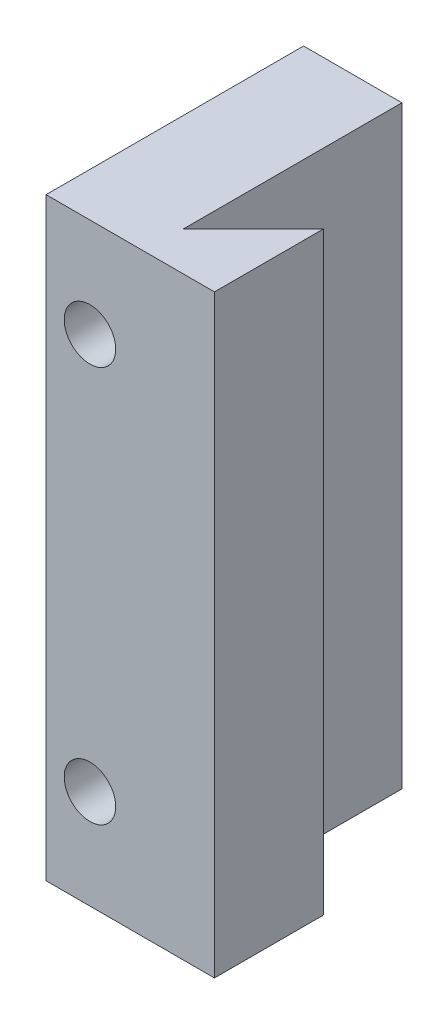
ISO-10303-21;
HEADER;
FILE_DESCRIPTION(('STEP AP214'),'2;1');
FILE_NAME('part.step','',(''),(''),'','','');
FILE_SCHEMA(('AUTOMOTIVE_DESIGN { 1 0 10303 214 1 1 1 1 }'));
ENDSEC;
DATA;
#1=APPLICATION_CONTEXT('core data for automotive mechanical design processes');
#2=APPLICATION_PROTOCOL_DEFINITION('international standard','automotive_design',2000,#1);
#3=PRODUCT_CONTEXT('',#1,'mechanical');
#4=PRODUCT('Part','Part','',(#3));
#5=PRODUCT_RELATED_PRODUCT_CATEGORY('part','',(#4));
#6=PRODUCT_DEFINITION_FORMATION('','',#4);
#7=PRODUCT_DEFINITION_CONTEXT('part definition',#1,'design');
#8=PRODUCT_DEFINITION('design','',#6,#7);
#9=PRODUCT_DEFINITION_SHAPE('','',#8);
#10=(LENGTH_UNIT() NAMED_UNIT(*) SI_UNIT(.MILLI.,.METRE.));
#11=(NAMED_UNIT(*) PLANE_ANGLE_UNIT() SI_UNIT($,.RADIAN.));
#12=(NAMED_UNIT(*) SI_UNIT($,.STERADIAN.) SOLID_ANGLE_UNIT());
#13=UNCERTAINTY_MEASURE_WITH_UNIT(LENGTH_MEASURE(1.E-05),#10,'distance_accuracy_value','');
#14=(GEOMETRIC_REPRESENTATION_CONTEXT(3) GLOBAL_UNCERTAINTY_ASSIGNED_CONTEXT((#13)) GLOBAL_UNIT_ASSIGNED_CONTEXT((#10,
#11,#12)) REPRESENTATION_CONTEXT('',''));
#15=CARTESIAN_POINT('',(0.,0.,0.));
#16=DIRECTION('',(0.,0.,1.));
#17=DIRECTION('',(1.,0.,0.));
#18=AXIS2_PLACEMENT_3D('',#15,#16,#17);
#19=CARTESIAN_POINT('',(53.2500000000001,25.,0.));
#20=DIRECTION('',(0.,0.,1.));
#21=DIRECTION('',(1.,0.,0.));
#22=AXIS2_PLACEMENT_3D('',#19,#20,#21);
#23=CYLINDRICAL_SURFACE('',#22,1.3);
#24=CARTESIAN_POINT('',(53.2500000000001,25.,5.));
#25=DIRECTION('',(0.,0.,-1.));
#26=DIRECTION('',(0.,1.,0.));
#27=AXIS2_PLACEMENT_3D('',#24,#25,#26);
#28=CIRCLE('',#27,1.3);
#29=CARTESIAN_POINT('',(54.5500000000001,25.,5.));
#30=VERTEX_POINT('',#29);
#31=EDGE_CURVE('E273',#30,#30,#28,.F.);
#32=CARTESIAN_POINT('',(53.2500000000001,25.,0.));
#33=DIRECTION('',(0.,0.,1.));
#34=DIRECTION('',(1.,0.,0.));
#35=AXIS2_PLACEMENT_3D('',#32,#33,#34);
#36=CIRCLE('',#35,1.3);
#37=CARTESIAN_POINT('',(54.5500000000001,25.,0.));
#38=VERTEX_POINT('',#37);
#39=EDGE_CURVE('E265',#38,#38,#36,.T.);
#40=CARTESIAN_POINT('',(54.5500000000001,25.,5.));
#41=CARTESIAN_POINT('',(54.5500000000001,25.,4.94791666666667));
#42=CARTESIAN_POINT('',(54.5500000000001,25.,4.89583333333333));
#43=CARTESIAN_POINT('',(54.5500000000001,25.,4.79166666666667));
#44=CARTESIAN_POINT('',(54.5500000000001,25.,4.73958333333333));
#45=CARTESIAN_POINT('',(54.5500000000001,25.,4.63541666666667));
#46=CARTESIAN_POINT('',(54.5500000000001,25.,4.58333333333333));
#47=CARTESIAN_POINT('',(54.5500000000001,25.,4.47916666666667));
#48=CARTESIAN_POINT('',(54.5500000000001,25.,4.42708333333333));
#49=CARTESIAN_POINT('',(54.5500000000001,25.,4.32291666666667));
#50=CARTESIAN_POINT('',(54.5500000000001,25.,4.27083333333333));
#51=CARTESIAN_POINT('',(54.5500000000001,25.,4.16666666666667));
#52=CARTESIAN_POINT('',(54.5500000000001,25.,4.11458333333333));
#53=CARTESIAN_POINT('',(54.5500000000001,25.,4.01041666666667));
#54=CARTESIAN_POINT('',(54.5500000000001,25.,3.95833333333333));
#55=CARTESIAN_POINT('',(54.5500000000001,25.,3.85416666666667));
#56=CARTESIAN_POINT('',(54.5500000000001,25.,3.80208333333333));
#57=CARTESIAN_POINT('',(54.5500000000001,25.,3.69791666666667));
#58=CARTESIAN_POINT('',(54.5500000000001,25.,3.64583333333333));
#59=CARTESIAN_POINT('',(54.5500000000001,25.,3.54166666666667));
#60=CARTESIAN_POINT('',(54.5500000000001,25.,3.48958333333333));
#61=CARTESIAN_POINT('',(54.5500000000001,25.,3.38541666666667));
#62=CARTESIAN_POINT('',(54.5500000000001,25.,3.33333333333333));
#63=CARTESIAN_POINT('',(54.5500000000001,25.,3.22916666666667));
#64=CARTESIAN_POINT('',(54.5500000000001,25.,3.17708333333333));
#65=CARTESIAN_POINT('',(54.5500000000001,25.,3.07291666666667));
#66=CARTESIAN_POINT('',(54.5500000000001,25.,3.02083333333333));
#67=CARTESIAN_POINT('',(54.5500000000001,25.,2.91666666666667));
#68=CARTESIAN_POINT('',(54.5500000000001,25.,2.86458333333333));
#69=CARTESIAN_POINT('',(54.5500000000001,25.,2.76041666666667));
#70=CARTESIAN_POINT('',(54.5500000000001,25.,2.70833333333333));
#71=CARTESIAN_POINT('',(54.5500000000001,25.,2.60416666666667));
#72=CARTESIAN_POINT('',(54.5500000000001,25.,2.55208333333333));
#73=CARTESIAN_POINT('',(54.5500000000001,25.,2.44791666666667));
#74=CARTESIAN_POINT('',(54.5500000000001,25.,2.39583333333333));
#75=CARTESIAN_POINT('',(54.5500000000001,25.,2.29166666666667));
#76=CARTESIAN_POINT('',(54.5500000000001,25.,2.23958333333333));
#77=CARTESIAN_POINT('',(54.5500000000001,25.,2.13541666666667));
#78=CARTESIAN_POINT('',(54.5500000000001,25.,2.08333333333333));
#79=CARTESIAN_POINT('',(54.5500000000001,25.,1.97916666666667));
#80=CARTESIAN_POINT('',(54.5500000000001,25.,1.92708333333333));
#81=CARTESIAN_POINT('',(54.5500000000001,25.,1.82291666666667));
#82=CARTESIAN_POINT('',(54.5500000000001,25.,1.77083333333333));
#83=CARTESIAN_POINT('',(54.5500000000001,25.,1.66666666666667));
#84=CARTESIAN_POINT('',(54.5500000000001,25.,1.61458333333333));
#85=CARTESIAN_POINT('',(54.5500000000001,25.,1.51041666666667));
#86=CARTESIAN_POINT('',(54.5500000000001,25.,1.45833333333333));
#87=CARTESIAN_POINT('',(54.5500000000001,25.,1.35416666666667));
#88=CARTESIAN_POINT('',(54.5500000000001,25.,1.30208333333333));
#89=CARTESIAN_POINT('',(54.5500000000001,25.,1.19791666666667));
#90=CARTESIAN_POINT('',(54.5500000000001,25.,1.14583333333333));
#91=CARTESIAN_POINT('',(54.5500000000001,25.,1.04166666666667));
#92=CARTESIAN_POINT('',(54.5500000000001,25.,0.989583333333333));
#93=CARTESIAN_POINT('',(54.5500000000001,25.,0.885416666666667));
#94=CARTESIAN_POINT('',(54.5500000000001,25.,0.833333333333333));
#95=CARTESIAN_POINT('',(54.5500000000001,25.,0.729166666666667));
#96=CARTESIAN_POINT('',(54.5500000000001,25.,0.677083333333334));
#97=CARTESIAN_POINT('',(54.5500000000001,25.,0.572916666666667));
#98=CARTESIAN_POINT('',(54.5500000000001,25.,0.520833333333334));
#99=CARTESIAN_POINT('',(54.5500000000001,25.,0.416666666666667));
#100=CARTESIAN_POINT('',(54.5500000000001,25.,0.364583333333334));
#101=CARTESIAN_POINT('',(54.5500000000001,25.,0.260416666666667));
#102=CARTESIAN_POINT('',(54.5500000000001,25.,0.208333333333333));
#103=CARTESIAN_POINT('',(54.5500000000001,25.,0.104166666666667));
#104=CARTESIAN_POINT('',(54.5500000000001,25.,0.0520833333333334));
#105=CARTESIAN_POINT('',(54.5500000000001,25.,0.));
#106=B_SPLINE_CURVE_WITH_KNOTS('',3,(#40,#41,#42,#43,#44,#45,#46,#47,#48,#49,#50,#51,#52,#53,
#54,#55,#56,#57,#58,#59,#60,#61,#62,#63,#64,#65,#66,#67,#68,#69,#70,#71,#72,#73,#74,#75,#76,#77,
#78,#79,#80,#81,#82,#83,#84,#85,#86,#87,#88,#89,#90,#91,#92,#93,#94,#95,#96,#97,#98,#99,#100,
#101,#102,#103,#104,#105),.UNSPECIFIED.,.F.,.F.,(4,2,2,2,2,2,2,2,2,2,2,2,2,2,2,2,2,2,2,2,2,2,2,
2,2,2,2,2,2,2,2,2,4),(0.,0.15625,0.3125,0.46875,0.625000000000001,0.78125,0.9375,1.09375,1.25,
1.40625,1.5625,1.71875,1.875,2.03125,2.1875,2.34375,2.5,2.65625,2.8125,2.96875,3.125,3.28125,
3.4375,3.59375,3.75,3.90625,4.0625,4.21875,4.375,4.53125,4.6875,4.84375,5.),.UNSPECIFIED.);
#107=EDGE_CURVE('BSEAM39',#30,#38,#106,.T.);
#108=ORIENTED_EDGE('',*,*,#31,.T.);
#109=ORIENTED_EDGE('',*,*,#39,.F.);
#110=ORIENTED_EDGE('',*,*,#107,.T.);
#111=ORIENTED_EDGE('',*,*,#107,.F.);
#112=EDGE_LOOP('',(#108,#110,#109,#111));
#113=FACE_BOUND('',#112,.T.);
#114=ADVANCED_FACE('F39',(#113),#23,.F.);
#115=CARTESIAN_POINT('',(53.2500000000001,45.,0.));
#116=DIRECTION('',(0.,0.,1.));
#117=DIRECTION('',(1.,0.,0.));
#118=AXIS2_PLACEMENT_3D('',#115,#116,#117);
#119=CYLINDRICAL_SURFACE('',#118,1.3);
#120=CARTESIAN_POINT('',(53.2500000000001,45.,5.));
#121=DIRECTION('',(0.,0.,-1.));
#122=DIRECTION('',(0.,1.,0.));
#123=AXIS2_PLACEMENT_3D('',#120,#121,#122);
#124=CIRCLE('',#123,1.3);
#125=CARTESIAN_POINT('',(54.5500000000001,45.,5.));
#126=VERTEX_POINT('',#125);
#127=EDGE_CURVE('E339',#126,#126,#124,.F.);
#128=CARTESIAN_POINT('',(53.2500000000001,45.,0.));
#129=DIRECTION('',(0.,0.,1.));
#130=DIRECTION('',(1.,0.,0.));
#131=AXIS2_PLACEMENT_3D('',#128,#129,#130);
#132=CIRCLE('',#131,1.3);
#133=CARTESIAN_POINT('',(54.5500000000001,45.,0.));
#134=VERTEX_POINT('',#133);
#135=EDGE_CURVE('E256',#134,#134,#132,.T.);
#136=CARTESIAN_POINT('',(54.5500000000001,45.,5.));
#137=CARTESIAN_POINT('',(54.5500000000001,45.,4.94791666666667));
#138=CARTESIAN_POINT('',(54.5500000000001,45.,4.89583333333333));
#139=CARTESIAN_POINT('',(54.5500000000001,45.,4.79166666666667));
#140=CARTESIAN_POINT('',(54.5500000000001,45.,4.73958333333333));
#141=CARTESIAN_POINT('',(54.5500000000001,45.,4.63541666666667));
#142=CARTESIAN_POINT('',(54.5500000000001,45.,4.58333333333333));
#143=CARTESIAN_POINT('',(54.5500000000001,45.,4.47916666666667));
#144=CARTESIAN_POINT('',(54.5500000000001,45.,4.42708333333333));
#145=CARTESIAN_POINT('',(54.5500000000001,45.,4.32291666666667));
#146=CARTESIAN_POINT('',(54.5500000000001,45.,4.27083333333333));
#147=CARTESIAN_POINT('',(54.5500000000001,45.,4.16666666666667));
#148=CARTESIAN_POINT('',(54.5500000000001,45.,4.11458333333333));
#149=CARTESIAN_POINT('',(54.5500000000001,45.,4.01041666666667));
#150=CARTESIAN_POINT('',(54.5500000000001,45.,3.95833333333333));
#151=CARTESIAN_POINT('',(54.5500000000001,45.,3.85416666666667));
#152=CARTESIAN_POINT('',(54.5500000000001,45.,3.80208333333333));
#153=CARTESIAN_POINT('',(54.5500000000001,45.,3.69791666666667));
#154=CARTESIAN_POINT('',(54.5500000000001,45.,3.64583333333333));
#155=CARTESIAN_POINT('',(54.5500000000001,45.,3.54166666666667));
#156=CARTESIAN_POINT('',(54.5500000000001,45.,3.48958333333333));
#157=CARTESIAN_POINT('',(54.5500000000001,45.,3.38541666666667));
#158=CARTESIAN_POINT('',(54.5500000000001,45.,3.33333333333333));
#159=CARTESIAN_POINT('',(54.5500000000001,45.,3.22916666666667));
#160=CARTESIAN_POINT('',(54.5500000000001,45.,3.17708333333333));
#161=CARTESIAN_POINT('',(54.5500000000001,45.,3.07291666666667));
#162=CARTESIAN_POINT('',(54.5500000000001,45.,3.02083333333333));
#163=CARTESIAN_POINT('',(54.5500000000001,45.,2.91666666666667));
#164=CARTESIAN_POINT('',(54.5500000000001,45.,2.86458333333333));
#165=CARTESIAN_POINT('',(54.5500000000001,45.,2.76041666666667));
#166=CARTESIAN_POINT('',(54.5500000000001,45.,2.70833333333333));
#167=CARTESIAN_POINT('',(54.5500000000001,45.,2.60416666666667));
#168=CARTESIAN_POINT('',(54.5500000000001,45.,2.55208333333333));
#169=CARTESIAN_POINT('',(54.5500000000001,45.,2.44791666666667));
#170=CARTESIAN_POINT('',(54.5500000000001,45.,2.39583333333333));
#171=CARTESIAN_POINT('',(54.5500000000001,45.,2.29166666666667));
#172=CARTESIAN_POINT('',(54.5500000000001,45.,2.23958333333333));
#173=CARTESIAN_POINT('',(54.5500000000001,45.,2.13541666666667));
#174=CARTESIAN_POINT('',(54.5500000000001,45.,2.08333333333333));
#175=CARTESIAN_POINT('',(54.5500000000001,45.,1.97916666666667));
#176=CARTESIAN_POINT('',(54.5500000000001,45.,1.92708333333333));
#177=CARTESIAN_POINT('',(54.5500000000001,45.,1.82291666666667));
#178=CARTESIAN_POINT('',(54.5500000000001,45.,1.77083333333333));
#179=CARTESIAN_POINT('',(54.5500000000001,45.,1.66666666666667));
#180=CARTESIAN_POINT('',(54.5500000000001,45.,1.61458333333333));
#181=CARTESIAN_POINT('',(54.5500000000001,45.,1.51041666666667));
#182=CARTESIAN_POINT('',(54.5500000000001,45.,1.45833333333333));
#183=CARTESIAN_POINT('',(54.5500000000001,45.,1.35416666666667));
#184=CARTESIAN_POINT('',(54.5500000000001,45.,1.30208333333333));
#185=CARTESIAN_POINT('',(54.5500000000001,45.,1.19791666666667));
#186=CARTESIAN_POINT('',(54.5500000000001,45.,1.14583333333333));
#187=CARTESIAN_POINT('',(54.5500000000001,45.,1.04166666666667));
#188=CARTESIAN_POINT('',(54.5500000000001,45.,0.989583333333333));
#189=CARTESIAN_POINT('',(54.5500000000001,45.,0.885416666666667));
#190=CARTESIAN_POINT('',(54.5500000000001,45.,0.833333333333333));
#191=CARTESIAN_POINT('',(54.5500000000001,45.,0.729166666666667));
#192=CARTESIAN_POINT('',(54.5500000000001,45.,0.677083333333334));
#193=CARTESIAN_POINT('',(54.5500000000001,45.,0.572916666666667));
#194=CARTESIAN_POINT('',(54.5500000000001,45.,0.520833333333334));
#195=CARTESIAN_POINT('',(54.5500000000001,45.,0.416666666666667));
#196=CARTESIAN_POINT('',(54.5500000000001,45.,0.364583333333334));
#197=CARTESIAN_POINT('',(54.5500000000001,45.,0.260416666666667));
#198=CARTESIAN_POINT('',(54.5500000000001,45.,0.208333333333333));
#199=CARTESIAN_POINT('',(54.5500000000001,45.,0.104166666666667));
#200=CARTESIAN_POINT('',(54.5500000000001,45.,0.0520833333333334));
#201=CARTESIAN_POINT('',(54.5500000000001,45.,0.));
#202=B_SPLINE_CURVE_WITH_KNOTS('',3,(#136,#137,#138,#139,#140,#141,#142,#143,#144,#145,#146,
#147,#148,#149,#150,#151,#152,#153,#154,#155,#156,#157,#158,#159,#160,#161,#162,#163,#164,#165,
#166,#167,#168,#169,#170,#171,#172,#173,#174,#175,#176,#177,#178,#179,#180,#181,#182,#183,#184,
#185,#186,#187,#188,#189,#190,#191,#192,#193,#194,#195,#196,#197,#198,#199,#200,#201),
.UNSPECIFIED.,.F.,.F.,(4,2,2,2,2,2,2,2,2,2,2,2,2,2,2,2,2,2,2,2,2,2,2,2,2,2,2,2,2,2,2,2,4),(0.,
0.15625,0.3125,0.46875,0.625000000000001,0.78125,0.9375,1.09375,1.25,1.40625,1.5625,1.71875,
1.875,2.03125,2.1875,2.34375,2.5,2.65625,2.8125,2.96875,3.125,3.28125,3.4375,3.59375,3.75,
3.90625,4.0625,4.21875,4.375,4.53125,4.6875,4.84375,5.),.UNSPECIFIED.);
#203=EDGE_CURVE('BSEAM371',#126,#134,#202,.T.);
#204=ORIENTED_EDGE('',*,*,#127,.T.);
#205=ORIENTED_EDGE('',*,*,#135,.F.);
#206=ORIENTED_EDGE('',*,*,#203,.T.);
#207=ORIENTED_EDGE('',*,*,#203,.F.);
#208=EDGE_LOOP('',(#204,#206,#205,#207));
#209=FACE_BOUND('',#208,.T.);
#210=ADVANCED_FACE('F371',(#209),#119,.F.);
#211=CARTESIAN_POINT('',(51.0355339059328,-0.0100000000000031,15.));
#212=DIRECTION('',(-1.,0.,0.));
#213=DIRECTION('',(0.,0.,1.));
#214=AXIS2_PLACEMENT_3D('',#211,#212,#213);
#215=PLANE('',#214);
#216=DIRECTION('',(0.,0.,-1.));
#217=VECTOR('',#216,1.);
#218=CARTESIAN_POINT('',(51.0355339059328,33.2023138233743,2.));
#219=LINE('',#218,#217);
#220=CARTESIAN_POINT('',(51.0355339059328,33.2023138233743,2.));
#221=VERTEX_POINT('',#220);
#222=CARTESIAN_POINT('',(51.0355339059328,33.2023138233743,0.));
#223=VERTEX_POINT('',#222);
#224=EDGE_CURVE('E55',#221,#223,#219,.T.);
#225=ORIENTED_EDGE('',*,*,#224,.F.);
#226=DIRECTION('',(0.,-1.,0.));
#227=VECTOR('',#226,1.);
#228=CARTESIAN_POINT('',(51.0355339059328,-0.0100000000000031,2.));
#229=LINE('',#228,#227);
#230=CARTESIAN_POINT('',(51.0355339059328,27.7976861766257,2.));
#231=VERTEX_POINT('',#230);
#232=EDGE_CURVE('E11',#221,#231,#229,.T.);
#233=ORIENTED_EDGE('',*,*,#232,.T.);
#234=DIRECTION('',(0.,0.,-1.));
#235=VECTOR('',#234,1.);
#236=CARTESIAN_POINT('',(51.0355339059328,27.7976861766257,2.));
#237=LINE('',#236,#235);
#238=CARTESIAN_POINT('',(51.0355339059328,27.7976861766257,0.));
#239=VERTEX_POINT('',#238);
#240=EDGE_CURVE('E159',#239,#231,#237,.F.);
#241=ORIENTED_EDGE('',*,*,#240,.F.);
#242=DIRECTION('',(0.,-1.,0.));
#243=VECTOR('',#242,1.);
#244=CARTESIAN_POINT('',(51.0355339059328,0.,0.));
#245=LINE('',#244,#243);
#246=CARTESIAN_POINT('',(51.0355339059328,20.,0.));
#247=VERTEX_POINT('',#246);
#248=EDGE_CURVE('E295',#239,#247,#245,.T.);
#249=ORIENTED_EDGE('',*,*,#248,.T.);
#250=DIRECTION('',(0.,0.,-1.));
#251=VECTOR('',#250,1.);
#252=CARTESIAN_POINT('',(51.0355339059328,20.,15.));
#253=LINE('',#252,#251);
#254=CARTESIAN_POINT('',(51.0355339059328,20.,13.));
#255=VERTEX_POINT('',#254);
#256=EDGE_CURVE('E281',#255,#247,#253,.T.);
#257=ORIENTED_EDGE('',*,*,#256,.F.);
#258=DIRECTION('',(0.,-1.,0.));
#259=VECTOR('',#258,1.);
#260=CARTESIAN_POINT('',(51.0355339059328,-0.0100000000000031,13.));
#261=LINE('',#260,#259);
#262=CARTESIAN_POINT('',(51.0355339059328,50.,13.));
#263=VERTEX_POINT('',#262);
#264=EDGE_CURVE('E291',#263,#255,#261,.T.);
#265=ORIENTED_EDGE('',*,*,#264,.F.);
#266=DIRECTION('',(0.,0.,1.));
#267=VECTOR('',#266,1.);
#268=CARTESIAN_POINT('',(51.0355339059328,50.,30.));
#269=LINE('',#268,#267);
#270=CARTESIAN_POINT('',(51.0355339059328,50.,0.));
#271=VERTEX_POINT('',#270);
#272=EDGE_CURVE('E317',#271,#263,#269,.T.);
#273=ORIENTED_EDGE('',*,*,#272,.F.);
#274=EDGE_CURVE('E168',#271,#223,#245,.T.);
#275=ORIENTED_EDGE('',*,*,#274,.T.);
#276=EDGE_LOOP('',(#225,#233,#241,#249,#257,#265,#273,#275));
#277=FACE_BOUND('',#276,.T.);
#278=DIRECTION('',(0.,-1.,0.));
#279=VECTOR('',#278,1.);
#280=CARTESIAN_POINT('',(51.0355339059328,46.9,5.));
#281=LINE('',#280,#279);
#282=CARTESIAN_POINT('',(51.0355339059328,46.9,5.));
#283=VERTEX_POINT('',#282);
#284=CARTESIAN_POINT('',(51.0355339059328,42.7,5.));
#285=VERTEX_POINT('',#284);
#286=EDGE_CURVE('E63',#283,#285,#281,.T.);
#287=ORIENTED_EDGE('',*,*,#286,.F.);
#288=DIRECTION('',(0.,0.,-1.));
#289=VECTOR('',#288,1.);
#290=CARTESIAN_POINT('',(51.0355339059328,46.9,5.));
#291=LINE('',#290,#289);
#292=CARTESIAN_POINT('',(51.0355339059328,46.9,6.8));
#293=VERTEX_POINT('',#292);
#294=EDGE_CURVE('E202',#293,#283,#291,.T.);
#295=ORIENTED_EDGE('',*,*,#294,.F.);
#296=DIRECTION('',(0.,1.,0.));
#297=VECTOR('',#296,1.);
#298=CARTESIAN_POINT('',(51.0355339059328,46.9,6.8));
#299=LINE('',#298,#297);
#300=CARTESIAN_POINT('',(51.0355339059328,42.7,6.8));
#301=VERTEX_POINT('',#300);
#302=EDGE_CURVE('E198',#301,#293,#299,.T.);
#303=ORIENTED_EDGE('',*,*,#302,.F.);
#304=DIRECTION('',(0.,0.,1.));
#305=VECTOR('',#304,1.);
#306=CARTESIAN_POINT('',(51.0355339059328,42.7,5.));
#307=LINE('',#306,#305);
#308=EDGE_CURVE('E193',#285,#301,#307,.T.);
#309=ORIENTED_EDGE('',*,*,#308,.F.);
#310=EDGE_LOOP('',(#287,#295,#303,#309));
#311=FACE_BOUND('',#310,.T.);
#312=DIRECTION('',(0.,-1.,0.));
#313=VECTOR('',#312,1.);
#314=CARTESIAN_POINT('',(51.0355339059328,26.9,5.));
#315=LINE('',#314,#313);
#316=CARTESIAN_POINT('',(51.0355339059328,26.9,5.));
#317=VERTEX_POINT('',#316);
#318=CARTESIAN_POINT('',(51.0355339059328,22.7,5.));
#319=VERTEX_POINT('',#318);
#320=EDGE_CURVE('E170',#317,#319,#315,.T.);
#321=ORIENTED_EDGE('',*,*,#320,.F.);
#322=DIRECTION('',(0.,0.,-1.));
#323=VECTOR('',#322,1.);
#324=CARTESIAN_POINT('',(51.0355339059328,26.9,5.));
#325=LINE('',#324,#323);
#326=CARTESIAN_POINT('',(51.0355339059328,26.9,6.8));
#327=VERTEX_POINT('',#326);
#328=EDGE_CURVE('E238',#327,#317,#325,.T.);
#329=ORIENTED_EDGE('',*,*,#328,.F.);
#330=DIRECTION('',(0.,1.,0.));
#331=VECTOR('',#330,1.);
#332=CARTESIAN_POINT('',(51.0355339059328,26.9,6.8));
#333=LINE('',#332,#331);
#334=CARTESIAN_POINT('',(51.0355339059328,22.7,6.8));
#335=VERTEX_POINT('',#334);
#336=EDGE_CURVE('E234',#335,#327,#333,.T.);
#337=ORIENTED_EDGE('',*,*,#336,.F.);
#338=DIRECTION('',(0.,0.,1.));
#339=VECTOR('',#338,1.);
#340=CARTESIAN_POINT('',(51.0355339059328,22.7,5.));
#341=LINE('',#340,#339);
#342=EDGE_CURVE('E174',#319,#335,#341,.T.);
#343=ORIENTED_EDGE('',*,*,#342,.F.);
#344=EDGE_LOOP('',(#321,#329,#337,#343));
#345=FACE_BOUND('',#344,.T.);
#346=ADVANCED_FACE('F164',(#277,#311,#345),#215,.T.);
#347=CARTESIAN_POINT('',(56.,0.,30.));
#348=DIRECTION('',(-1.,0.,0.));
#349=DIRECTION('',(0.,-1.,0.));
#350=AXIS2_PLACEMENT_3D('',#347,#348,#349);
#351=PLANE('',#350);
#352=DIRECTION('',(0.,0.,1.));
#353=VECTOR('',#352,1.);
#354=CARTESIAN_POINT('',(56.,46.9,5.));
#355=LINE('',#354,#353);
#356=CARTESIAN_POINT('',(56.,46.9,5.));
#357=VERTEX_POINT('',#356);
#358=CARTESIAN_POINT('',(56.,46.9,6.8));
#359=VERTEX_POINT('',#358);
#360=EDGE_CURVE('E183',#357,#359,#355,.T.);
#361=ORIENTED_EDGE('',*,*,#360,.F.);
#362=DIRECTION('',(0.,1.,0.));
#363=VECTOR('',#362,1.);
#364=CARTESIAN_POINT('',(56.,46.9,5.));
#365=LINE('',#364,#363);
#366=CARTESIAN_POINT('',(56.,42.7,5.));
#367=VERTEX_POINT('',#366);
#368=EDGE_CURVE('E187',#367,#357,#365,.T.);
#369=ORIENTED_EDGE('',*,*,#368,.F.);
#370=DIRECTION('',(0.,0.,-1.));
#371=VECTOR('',#370,1.);
#372=CARTESIAN_POINT('',(56.,42.7,5.));
#373=LINE('',#372,#371);
#374=CARTESIAN_POINT('',(56.,42.7,6.8));
#375=VERTEX_POINT('',#374);
#376=EDGE_CURVE('E190',#375,#367,#373,.T.);
#377=ORIENTED_EDGE('',*,*,#376,.F.);
#378=DIRECTION('',(0.,-1.,0.));
#379=VECTOR('',#378,1.);
#380=CARTESIAN_POINT('',(56.,46.9,6.8));
#381=LINE('',#380,#379);
#382=EDGE_CURVE('E179',#359,#375,#381,.T.);
#383=ORIENTED_EDGE('',*,*,#382,.F.);
#384=EDGE_LOOP('',(#361,#369,#377,#383));
#385=FACE_BOUND('',#384,.T.);
#386=DIRECTION('',(0.,0.,1.));
#387=VECTOR('',#386,1.);
#388=CARTESIAN_POINT('',(56.,26.9,5.));
#389=LINE('',#388,#387);
#390=CARTESIAN_POINT('',(56.,26.9,5.));
#391=VERTEX_POINT('',#390);
#392=CARTESIAN_POINT('',(56.,26.9,6.8));
#393=VERTEX_POINT('',#392);
#394=EDGE_CURVE('E224',#391,#393,#389,.T.);
#395=ORIENTED_EDGE('',*,*,#394,.F.);
#396=DIRECTION('',(0.,1.,0.));
#397=VECTOR('',#396,1.);
#398=CARTESIAN_POINT('',(56.,26.9,5.));
#399=LINE('',#398,#397);
#400=CARTESIAN_POINT('',(56.,22.7,5.));
#401=VERTEX_POINT('',#400);
#402=EDGE_CURVE('E228',#401,#391,#399,.T.);
#403=ORIENTED_EDGE('',*,*,#402,.F.);
#404=DIRECTION('',(0.,0.,-1.));
#405=VECTOR('',#404,1.);
#406=CARTESIAN_POINT('',(56.,22.7,5.));
#407=LINE('',#406,#405);
#408=CARTESIAN_POINT('',(56.,22.7,6.8));
#409=VERTEX_POINT('',#408);
#410=EDGE_CURVE('E194',#409,#401,#407,.T.);
#411=ORIENTED_EDGE('',*,*,#410,.F.);
#412=DIRECTION('',(0.,-1.,0.));
#413=VECTOR('',#412,1.);
#414=CARTESIAN_POINT('',(56.,26.9,6.8));
#415=LINE('',#414,#413);
#416=EDGE_CURVE('E220',#393,#409,#415,.T.);
#417=ORIENTED_EDGE('',*,*,#416,.F.);
#418=EDGE_LOOP('',(#395,#403,#411,#417));
#419=FACE_BOUND('',#418,.T.);
#420=DIRECTION('',(0.,1.,0.));
#421=VECTOR('',#420,1.);
#422=CARTESIAN_POINT('',(56.0000000000001,20.,11.0355339059327));
#423=LINE('',#422,#421);
#424=CARTESIAN_POINT('',(56.0000000000001,20.,11.0355339059327));
#425=VERTEX_POINT('',#424);
#426=CARTESIAN_POINT('',(56.,50.,11.0355339059327));
#427=VERTEX_POINT('',#426);
#428=EDGE_CURVE('E301',#425,#427,#423,.T.);
#429=ORIENTED_EDGE('',*,*,#428,.F.);
#430=DIRECTION('',(0.,0.,-1.));
#431=VECTOR('',#430,1.);
#432=CARTESIAN_POINT('',(56.,20.,30.));
#433=LINE('',#432,#431);
#434=CARTESIAN_POINT('',(56.,20.,0.));
#435=VERTEX_POINT('',#434);
#436=EDGE_CURVE('E277',#425,#435,#433,.T.);
#437=ORIENTED_EDGE('',*,*,#436,.T.);
#438=DIRECTION('',(0.,1.,0.));
#439=VECTOR('',#438,1.);
#440=CARTESIAN_POINT('',(56.,0.,0.));
#441=LINE('',#440,#439);
#442=CARTESIAN_POINT('',(56.,50.,0.));
#443=VERTEX_POINT('',#442);
#444=EDGE_CURVE('E296',#435,#443,#441,.T.);
#445=ORIENTED_EDGE('',*,*,#444,.T.);
#446=DIRECTION('',(0.,0.,-1.));
#447=VECTOR('',#446,1.);
#448=CARTESIAN_POINT('',(56.,50.,30.));
#449=LINE('',#448,#447);
#450=EDGE_CURVE('E321',#427,#443,#449,.T.);
#451=ORIENTED_EDGE('',*,*,#450,.F.);
#452=EDGE_LOOP('',(#429,#437,#445,#451));
#453=FACE_BOUND('',#452,.T.);
#454=ADVANCED_FACE('F379',(#385,#419,#453),#351,.F.);
#455=CARTESIAN_POINT('',(59.5355339059328,20.,7.5));
#456=DIRECTION('',(-0.707106781186547,0.,-0.707106781186548));
#457=DIRECTION('',(-0.707106781186548,0.,0.707106781186547));
#458=AXIS2_PLACEMENT_3D('',#455,#456,#457);
#459=PLANE('',#458);
#460=DIRECTION('',(-0.707106781186548,0.,0.707106781186547));
#461=VECTOR('',#460,1.);
#462=CARTESIAN_POINT('',(59.5355339059328,50.,7.5));
#463=LINE('',#462,#461);
#464=CARTESIAN_POINT('',(59.5355339059328,50.,7.5));
#465=VERTEX_POINT('',#464);
#466=EDGE_CURVE('E309',#465,#427,#463,.T.);
#467=ORIENTED_EDGE('',*,*,#466,.F.);
#468=DIRECTION('',(0.,1.,0.));
#469=VECTOR('',#468,1.);
#470=CARTESIAN_POINT('',(59.5355339059328,20.,7.5));
#471=LINE('',#470,#469);
#472=CARTESIAN_POINT('',(59.5355339059328,20.,7.5));
#473=VERTEX_POINT('',#472);
#474=EDGE_CURVE('E299',#473,#465,#471,.T.);
#475=ORIENTED_EDGE('',*,*,#474,.F.);
#476=DIRECTION('',(-0.707106781186548,0.,0.707106781186547));
#477=VECTOR('',#476,1.);
#478=CARTESIAN_POINT('',(59.5355339059328,20.,7.5));
#479=LINE('',#478,#477);
#480=EDGE_CURVE('E313',#473,#425,#479,.T.);
#481=ORIENTED_EDGE('',*,*,#480,.T.);
#482=ORIENTED_EDGE('',*,*,#428,.T.);
#483=EDGE_LOOP('',(#467,#475,#481,#482));
#484=FACE_BOUND('',#483,.T.);
#485=ADVANCED_FACE('F418',(#484),#459,.T.);
#486=CARTESIAN_POINT('',(0.,20.,0.));
#487=DIRECTION('',(0.,-1.,0.));
#488=DIRECTION('',(0.,0.,-1.));
#489=AXIS2_PLACEMENT_3D('',#486,#487,#488);
#490=PLANE('',#489);
#491=DIRECTION('',(1.,0.,0.));
#492=VECTOR('',#491,1.);
#493=CARTESIAN_POINT('',(0.,20.,13.));
#494=LINE('',#493,#492);
#495=CARTESIAN_POINT('',(59.5355339059328,20.,13.));
#496=VERTEX_POINT('',#495);
#497=EDGE_CURVE('E288',#255,#496,#494,.T.);
#498=ORIENTED_EDGE('',*,*,#497,.F.);
#499=ORIENTED_EDGE('',*,*,#256,.T.);
#500=DIRECTION('',(-1.,0.,0.));
#501=VECTOR('',#500,1.);
#502=CARTESIAN_POINT('',(51.0000000000001,20.,0.));
#503=LINE('',#502,#501);
#504=EDGE_CURVE('E260',#435,#247,#503,.T.);
#505=ORIENTED_EDGE('',*,*,#504,.F.);
#506=ORIENTED_EDGE('',*,*,#436,.F.);
#507=ORIENTED_EDGE('',*,*,#480,.F.);
#508=DIRECTION('',(0.,0.,-1.));
#509=VECTOR('',#508,1.);
#510=CARTESIAN_POINT('',(59.5355339059328,20.,7.5));
#511=LINE('',#510,#509);
#512=EDGE_CURVE('E305',#496,#473,#511,.T.);
#513=ORIENTED_EDGE('',*,*,#512,.F.);
#514=EDGE_LOOP('',(#498,#499,#505,#506,#507,#513));
#515=FACE_BOUND('',#514,.T.);
#516=ADVANCED_FACE('F411',(#515),#490,.T.);
#517=CARTESIAN_POINT('',(0.,50.,30.));
#518=DIRECTION('',(0.,1.,0.));
#519=DIRECTION('',(0.,0.,1.));
#520=AXIS2_PLACEMENT_3D('',#517,#518,#519);
#521=PLANE('',#520);
#522=DIRECTION('',(-1.,0.,0.));
#523=VECTOR('',#522,1.);
#524=CARTESIAN_POINT('',(49.0355339059328,50.,13.));
#525=LINE('',#524,#523);
#526=CARTESIAN_POINT('',(59.5355339059328,50.,13.));
#527=VERTEX_POINT('',#526);
#528=EDGE_CURVE('E285',#527,#263,#525,.T.);
#529=ORIENTED_EDGE('',*,*,#528,.F.);
#530=DIRECTION('',(0.,0.,-1.));
#531=VECTOR('',#530,1.);
#532=CARTESIAN_POINT('',(59.5355339059328,50.,7.5));
#533=LINE('',#532,#531);
#534=EDGE_CURVE('E312',#527,#465,#533,.T.);
#535=ORIENTED_EDGE('',*,*,#534,.T.);
#536=ORIENTED_EDGE('',*,*,#466,.T.);
#537=ORIENTED_EDGE('',*,*,#450,.T.);
#538=DIRECTION('',(1.,0.,0.));
#539=VECTOR('',#538,1.);
#540=CARTESIAN_POINT('',(0.,50.,0.));
#541=LINE('',#540,#539);
#542=EDGE_CURVE('E300',#271,#443,#541,.T.);
#543=ORIENTED_EDGE('',*,*,#542,.F.);
#544=ORIENTED_EDGE('',*,*,#272,.T.);
#545=EDGE_LOOP('',(#529,#535,#536,#537,#543,#544));
#546=FACE_BOUND('',#545,.T.);
#547=ADVANCED_FACE('F402',(#546),#521,.T.);
#548=CARTESIAN_POINT('',(59.5355339059328,20.,7.5));
#549=DIRECTION('',(1.,0.,0.));
#550=DIRECTION('',(0.,0.,-1.));
#551=AXIS2_PLACEMENT_3D('',#548,#549,#550);
#552=PLANE('',#551);
#553=DIRECTION('',(0.,1.,0.));
#554=VECTOR('',#553,1.);
#555=CARTESIAN_POINT('',(59.5355339059328,20.,13.));
#556=LINE('',#555,#554);
#557=EDGE_CURVE('E48',#496,#527,#556,.T.);
#558=ORIENTED_EDGE('',*,*,#557,.F.);
#559=ORIENTED_EDGE('',*,*,#512,.T.);
#560=ORIENTED_EDGE('',*,*,#474,.T.);
#561=ORIENTED_EDGE('',*,*,#534,.F.);
#562=EDGE_LOOP('',(#558,#559,#560,#561));
#563=FACE_BOUND('',#562,.T.);
#564=ADVANCED_FACE('F41',(#563),#552,.T.);
#565=CARTESIAN_POINT('',(0.,0.,0.));
#566=DIRECTION('',(0.,0.,1.));
#567=DIRECTION('',(1.,0.,0.));
#568=AXIS2_PLACEMENT_3D('',#565,#566,#567);
#569=PLANE('',#568);
#570=ORIENTED_EDGE('',*,*,#135,.T.);
#571=EDGE_LOOP('',(#570));
#572=FACE_BOUND('',#571,.T.);
#573=ORIENTED_EDGE('',*,*,#39,.T.);
#574=EDGE_LOOP('',(#573));
#575=FACE_BOUND('',#574,.T.);
#576=ORIENTED_EDGE('',*,*,#248,.F.);
#577=CARTESIAN_POINT('',(48.4355339059328,30.5,0.));
#578=DIRECTION('',(0.,0.,-1.));
#579=DIRECTION('',(-1.,0.,0.));
#580=AXIS2_PLACEMENT_3D('',#577,#578,#579);
#581=CIRCLE('',#580,3.75);
#582=EDGE_CURVE('E161',#223,#239,#581,.T.);
#583=ORIENTED_EDGE('',*,*,#582,.F.);
#584=ORIENTED_EDGE('',*,*,#274,.F.);
#585=ORIENTED_EDGE('',*,*,#542,.T.);
#586=ORIENTED_EDGE('',*,*,#444,.F.);
#587=ORIENTED_EDGE('',*,*,#504,.T.);
#588=EDGE_LOOP('',(#576,#583,#584,#585,#586,#587));
#589=FACE_BOUND('',#588,.T.);
#590=ADVANCED_FACE('F390',(#572,#575,#589),#569,.F.);
#591=CARTESIAN_POINT('',(49.0355339059328,0.,13.));
#592=DIRECTION('',(0.,0.,-1.));
#593=DIRECTION('',(-1.,0.,0.));
#594=AXIS2_PLACEMENT_3D('',#591,#592,#593);
#595=PLANE('',#594);
#596=CARTESIAN_POINT('',(53.2500000000001,45.,13.));
#597=DIRECTION('',(0.,0.,1.));
#598=DIRECTION('',(1.,0.,0.));
#599=AXIS2_PLACEMENT_3D('',#596,#597,#598);
#600=CIRCLE('',#599,1.3);
#601=CARTESIAN_POINT('',(54.5500000000001,45.,13.));
#602=VERTEX_POINT('',#601);
#603=EDGE_CURVE('E261',#602,#602,#600,.T.);
#604=ORIENTED_EDGE('',*,*,#603,.F.);
#605=EDGE_LOOP('',(#604));
#606=FACE_BOUND('',#605,.T.);
#607=CARTESIAN_POINT('',(53.2500000000001,25.,13.));
#608=DIRECTION('',(0.,0.,1.));
#609=DIRECTION('',(1.,0.,0.));
#610=AXIS2_PLACEMENT_3D('',#607,#608,#609);
#611=CIRCLE('',#610,1.3);
#612=CARTESIAN_POINT('',(54.5500000000001,25.,13.));
#613=VERTEX_POINT('',#612);
#614=EDGE_CURVE('E269',#613,#613,#611,.T.);
#615=ORIENTED_EDGE('',*,*,#614,.F.);
#616=EDGE_LOOP('',(#615));
#617=FACE_BOUND('',#616,.T.);
#618=ORIENTED_EDGE('',*,*,#264,.T.);
#619=ORIENTED_EDGE('',*,*,#497,.T.);
#620=ORIENTED_EDGE('',*,*,#557,.T.);
#621=ORIENTED_EDGE('',*,*,#528,.T.);
#622=EDGE_LOOP('',(#618,#619,#620,#621));
#623=FACE_BOUND('',#622,.T.);
#624=ADVANCED_FACE('F382',(#606,#617,#623),#595,.F.);
#625=CARTESIAN_POINT('',(53.2500000000001,25.,6.8));
#626=DIRECTION('',(0.,0.,1.));
#627=DIRECTION('',(0.,-1.,0.));
#628=AXIS2_PLACEMENT_3D('',#625,#626,#627);
#629=CIRCLE('',#628,1.3);
#630=CARTESIAN_POINT('',(54.5500000000001,25.,6.8));
#631=VERTEX_POINT('',#630);
#632=EDGE_CURVE('E343',#631,#631,#629,.F.);
#633=CARTESIAN_POINT('',(54.5500000000001,25.,6.8));
#634=CARTESIAN_POINT('',(54.5500000000001,25.,6.86458333333333));
#635=CARTESIAN_POINT('',(54.5500000000001,25.,6.92916666666667));
#636=CARTESIAN_POINT('',(54.5500000000001,25.,7.05833333333333));
#637=CARTESIAN_POINT('',(54.5500000000001,25.,7.12291666666667));
#638=CARTESIAN_POINT('',(54.5500000000001,25.,7.25208333333333));
#639=CARTESIAN_POINT('',(54.5500000000001,25.,7.31666666666667));
#640=CARTESIAN_POINT('',(54.5500000000001,25.,7.44583333333333));
#641=CARTESIAN_POINT('',(54.5500000000001,25.,7.51041666666667));
#642=CARTESIAN_POINT('',(54.5500000000001,25.,7.63958333333333));
#643=CARTESIAN_POINT('',(54.5500000000001,25.,7.70416666666667));
#644=CARTESIAN_POINT('',(54.5500000000001,25.,7.83333333333333));
#645=CARTESIAN_POINT('',(54.5500000000001,25.,7.89791666666667));
#646=CARTESIAN_POINT('',(54.5500000000001,25.,8.02708333333333));
#647=CARTESIAN_POINT('',(54.5500000000001,25.,8.09166666666667));
#648=CARTESIAN_POINT('',(54.5500000000001,25.,8.22083333333333));
#649=CARTESIAN_POINT('',(54.5500000000001,25.,8.28541666666666));
#650=CARTESIAN_POINT('',(54.5500000000001,25.,8.41458333333333));
#651=CARTESIAN_POINT('',(54.5500000000001,25.,8.47916666666667));
#652=CARTESIAN_POINT('',(54.5500000000001,25.,8.60833333333333));
#653=CARTESIAN_POINT('',(54.5500000000001,25.,8.67291666666667));
#654=CARTESIAN_POINT('',(54.5500000000001,25.,8.80208333333333));
#655=CARTESIAN_POINT('',(54.5500000000001,25.,8.86666666666667));
#656=CARTESIAN_POINT('',(54.5500000000001,25.,8.99583333333333));
#657=CARTESIAN_POINT('',(54.5500000000001,25.,9.06041666666667));
#658=CARTESIAN_POINT('',(54.5500000000001,25.,9.18958333333333));
#659=CARTESIAN_POINT('',(54.5500000000001,25.,9.25416666666667));
#660=CARTESIAN_POINT('',(54.5500000000001,25.,9.38333333333333));
#661=CARTESIAN_POINT('',(54.5500000000001,25.,9.44791666666667));
#662=CARTESIAN_POINT('',(54.5500000000001,25.,9.57708333333333));
#663=CARTESIAN_POINT('',(54.5500000000001,25.,9.64166666666667));
#664=CARTESIAN_POINT('',(54.5500000000001,25.,9.77083333333333));
#665=CARTESIAN_POINT('',(54.5500000000001,25.,9.83541666666667));
#666=CARTESIAN_POINT('',(54.5500000000001,25.,9.96458333333333));
#667=CARTESIAN_POINT('',(54.5500000000001,25.,10.0291666666667));
#668=CARTESIAN_POINT('',(54.5500000000001,25.,10.1583333333333));
#669=CARTESIAN_POINT('',(54.5500000000001,25.,10.2229166666667));
#670=CARTESIAN_POINT('',(54.5500000000001,25.,10.3520833333333));
#671=CARTESIAN_POINT('',(54.5500000000001,25.,10.4166666666667));
#672=CARTESIAN_POINT('',(54.5500000000001,25.,10.5458333333333));
#673=CARTESIAN_POINT('',(54.5500000000001,25.,10.6104166666667));
#674=CARTESIAN_POINT('',(54.5500000000001,25.,10.7395833333333));
#675=CARTESIAN_POINT('',(54.5500000000001,25.,10.8041666666667));
#676=CARTESIAN_POINT('',(54.5500000000001,25.,10.9333333333333));
#677=CARTESIAN_POINT('',(54.5500000000001,25.,10.9979166666667));
#678=CARTESIAN_POINT('',(54.5500000000001,25.,11.1270833333333));
#679=CARTESIAN_POINT('',(54.5500000000001,25.,11.1916666666667));
#680=CARTESIAN_POINT('',(54.5500000000001,25.,11.3208333333333));
#681=CARTESIAN_POINT('',(54.5500000000001,25.,11.3854166666667));
#682=CARTESIAN_POINT('',(54.5500000000001,25.,11.5145833333333));
#683=CARTESIAN_POINT('',(54.5500000000001,25.,11.5791666666667));
#684=CARTESIAN_POINT('',(54.5500000000001,25.,11.7083333333333));
#685=CARTESIAN_POINT('',(54.5500000000001,25.,11.7729166666667));
#686=CARTESIAN_POINT('',(54.5500000000001,25.,11.9020833333333));
#687=CARTESIAN_POINT('',(54.5500000000001,25.,11.9666666666667));
#688=CARTESIAN_POINT('',(54.5500000000001,25.,12.0958333333333));
#689=CARTESIAN_POINT('',(54.5500000000001,25.,12.1604166666667));
#690=CARTESIAN_POINT('',(54.5500000000001,25.,12.2895833333333));
#691=CARTESIAN_POINT('',(54.5500000000001,25.,12.3541666666667));
#692=CARTESIAN_POINT('',(54.5500000000001,25.,12.4833333333333));
#693=CARTESIAN_POINT('',(54.5500000000001,25.,12.5479166666667));
#694=CARTESIAN_POINT('',(54.5500000000001,25.,12.6770833333333));
#695=CARTESIAN_POINT('',(54.5500000000001,25.,12.7416666666667));
#696=CARTESIAN_POINT('',(54.5500000000001,25.,12.8708333333333));
#697=CARTESIAN_POINT('',(54.5500000000001,25.,12.9354166666667));
#698=CARTESIAN_POINT('',(54.5500000000001,25.,13.));
#699=B_SPLINE_CURVE_WITH_KNOTS('',3,(#633,#634,#635,#636,#637,#638,#639,#640,#641,#642,#643,
#644,#645,#646,#647,#648,#649,#650,#651,#652,#653,#654,#655,#656,#657,#658,#659,#660,#661,#662,
#663,#664,#665,#666,#667,#668,#669,#670,#671,#672,#673,#674,#675,#676,#677,#678,#679,#680,#681,
#682,#683,#684,#685,#686,#687,#688,#689,#690,#691,#692,#693,#694,#695,#696,#697,#698),
.UNSPECIFIED.,.F.,.F.,(4,2,2,2,2,2,2,2,2,2,2,2,2,2,2,2,2,2,2,2,2,2,2,2,2,2,2,2,2,2,2,2,4),(0.,
0.19375,0.3875,0.58125,0.775,0.96875,1.1625,1.35625,1.55,1.74375,1.9375,2.13125,2.325,2.51875,
2.7125,2.90625,3.1,3.29375,3.4875,3.68125,3.875,4.06875,4.2625,4.45625,4.65,4.84375,5.0375,
5.23125,5.425,5.61875,5.8125,6.00625,6.2),.UNSPECIFIED.);
#700=EDGE_CURVE('BSEAM373',#631,#613,#699,.T.);
#701=ORIENTED_EDGE('',*,*,#632,.T.);
#702=ORIENTED_EDGE('',*,*,#614,.T.);
#703=ORIENTED_EDGE('',*,*,#700,.T.);
#704=ORIENTED_EDGE('',*,*,#700,.F.);
#705=EDGE_LOOP('',(#701,#703,#702,#704));
#706=FACE_BOUND('',#705,.T.);
#707=ADVANCED_FACE('F373',(#706),#23,.F.);
#708=CARTESIAN_POINT('',(53.2500000000001,45.,6.8));
#709=DIRECTION('',(0.,0.,1.));
#710=DIRECTION('',(0.,-1.,0.));
#711=AXIS2_PLACEMENT_3D('',#708,#709,#710);
#712=CIRCLE('',#711,1.3);
#713=CARTESIAN_POINT('',(54.5500000000001,45.,6.8));
#714=VERTEX_POINT('',#713);
#715=EDGE_CURVE('E219',#714,#714,#712,.F.);
#716=CARTESIAN_POINT('',(54.5500000000001,45.,6.8));
#717=CARTESIAN_POINT('',(54.5500000000001,45.,6.86458333333333));
#718=CARTESIAN_POINT('',(54.5500000000001,45.,6.92916666666667));
#719=CARTESIAN_POINT('',(54.5500000000001,45.,7.05833333333333));
#720=CARTESIAN_POINT('',(54.5500000000001,45.,7.12291666666667));
#721=CARTESIAN_POINT('',(54.5500000000001,45.,7.25208333333333));
#722=CARTESIAN_POINT('',(54.5500000000001,45.,7.31666666666667));
#723=CARTESIAN_POINT('',(54.5500000000001,45.,7.44583333333333));
#724=CARTESIAN_POINT('',(54.5500000000001,45.,7.51041666666667));
#725=CARTESIAN_POINT('',(54.5500000000001,45.,7.63958333333333));
#726=CARTESIAN_POINT('',(54.5500000000001,45.,7.70416666666667));
#727=CARTESIAN_POINT('',(54.5500000000001,45.,7.83333333333333));
#728=CARTESIAN_POINT('',(54.5500000000001,45.,7.89791666666667));
#729=CARTESIAN_POINT('',(54.5500000000001,45.,8.02708333333333));
#730=CARTESIAN_POINT('',(54.5500000000001,45.,8.09166666666667));
#731=CARTESIAN_POINT('',(54.5500000000001,45.,8.22083333333333));
#732=CARTESIAN_POINT('',(54.5500000000001,45.,8.28541666666666));
#733=CARTESIAN_POINT('',(54.5500000000001,45.,8.41458333333333));
#734=CARTESIAN_POINT('',(54.5500000000001,45.,8.47916666666667));
#735=CARTESIAN_POINT('',(54.5500000000001,45.,8.60833333333333));
#736=CARTESIAN_POINT('',(54.5500000000001,45.,8.67291666666667));
#737=CARTESIAN_POINT('',(54.5500000000001,45.,8.80208333333333));
#738=CARTESIAN_POINT('',(54.5500000000001,45.,8.86666666666667));
#739=CARTESIAN_POINT('',(54.5500000000001,45.,8.99583333333333));
#740=CARTESIAN_POINT('',(54.5500000000001,45.,9.06041666666667));
#741=CARTESIAN_POINT('',(54.5500000000001,45.,9.18958333333333));
#742=CARTESIAN_POINT('',(54.5500000000001,45.,9.25416666666667));
#743=CARTESIAN_POINT('',(54.5500000000001,45.,9.38333333333333));
#744=CARTESIAN_POINT('',(54.5500000000001,45.,9.44791666666667));
#745=CARTESIAN_POINT('',(54.5500000000001,45.,9.57708333333333));
#746=CARTESIAN_POINT('',(54.5500000000001,45.,9.64166666666667));
#747=CARTESIAN_POINT('',(54.5500000000001,45.,9.77083333333333));
#748=CARTESIAN_POINT('',(54.5500000000001,45.,9.83541666666667));
#749=CARTESIAN_POINT('',(54.5500000000001,45.,9.96458333333333));
#750=CARTESIAN_POINT('',(54.5500000000001,45.,10.0291666666667));
#751=CARTESIAN_POINT('',(54.5500000000001,45.,10.1583333333333));
#752=CARTESIAN_POINT('',(54.5500000000001,45.,10.2229166666667));
#753=CARTESIAN_POINT('',(54.5500000000001,45.,10.3520833333333));
#754=CARTESIAN_POINT('',(54.5500000000001,45.,10.4166666666667));
#755=CARTESIAN_POINT('',(54.5500000000001,45.,10.5458333333333));
#756=CARTESIAN_POINT('',(54.5500000000001,45.,10.6104166666667));
#757=CARTESIAN_POINT('',(54.5500000000001,45.,10.7395833333333));
#758=CARTESIAN_POINT('',(54.5500000000001,45.,10.8041666666667));
#759=CARTESIAN_POINT('',(54.5500000000001,45.,10.9333333333333));
#760=CARTESIAN_POINT('',(54.5500000000001,45.,10.9979166666667));
#761=CARTESIAN_POINT('',(54.5500000000001,45.,11.1270833333333));
#762=CARTESIAN_POINT('',(54.5500000000001,45.,11.1916666666667));
#763=CARTESIAN_POINT('',(54.5500000000001,45.,11.3208333333333));
#764=CARTESIAN_POINT('',(54.5500000000001,45.,11.3854166666667));
#765=CARTESIAN_POINT('',(54.5500000000001,45.,11.5145833333333));
#766=CARTESIAN_POINT('',(54.5500000000001,45.,11.5791666666667));
#767=CARTESIAN_POINT('',(54.5500000000001,45.,11.7083333333333));
#768=CARTESIAN_POINT('',(54.5500000000001,45.,11.7729166666667));
#769=CARTESIAN_POINT('',(54.5500000000001,45.,11.9020833333333));
#770=CARTESIAN_POINT('',(54.5500000000001,45.,11.9666666666667));
#771=CARTESIAN_POINT('',(54.5500000000001,45.,12.0958333333333));
#772=CARTESIAN_POINT('',(54.5500000000001,45.,12.1604166666667));
#773=CARTESIAN_POINT('',(54.5500000000001,45.,12.2895833333333));
#774=CARTESIAN_POINT('',(54.5500000000001,45.,12.3541666666667));
#775=CARTESIAN_POINT('',(54.5500000000001,45.,12.4833333333333));
#776=CARTESIAN_POINT('',(54.5500000000001,45.,12.5479166666667));
#777=CARTESIAN_POINT('',(54.5500000000001,45.,12.6770833333333));
#778=CARTESIAN_POINT('',(54.5500000000001,45.,12.7416666666667));
#779=CARTESIAN_POINT('',(54.5500000000001,45.,12.8708333333333));
#780=CARTESIAN_POINT('',(54.5500000000001,45.,12.9354166666667));
#781=CARTESIAN_POINT('',(54.5500000000001,45.,13.));
#782=B_SPLINE_CURVE_WITH_KNOTS('',3,(#716,#717,#718,#719,#720,#721,#722,#723,#724,#725,#726,
#727,#728,#729,#730,#731,#732,#733,#734,#735,#736,#737,#738,#739,#740,#741,#742,#743,#744,#745,
#746,#747,#748,#749,#750,#751,#752,#753,#754,#755,#756,#757,#758,#759,#760,#761,#762,#763,#764,
#765,#766,#767,#768,#769,#770,#771,#772,#773,#774,#775,#776,#777,#778,#779,#780,#781),
.UNSPECIFIED.,.F.,.F.,(4,2,2,2,2,2,2,2,2,2,2,2,2,2,2,2,2,2,2,2,2,2,2,2,2,2,2,2,2,2,2,2,4),(0.,
0.19375,0.3875,0.58125,0.775,0.96875,1.1625,1.35625,1.55,1.74375,1.9375,2.13125,2.325,2.51875,
2.7125,2.90625,3.1,3.29375,3.4875,3.68125,3.875,4.06875,4.2625,4.45625,4.65,4.84375,5.0375,
5.23125,5.425,5.61875,5.8125,6.00625,6.2),.UNSPECIFIED.);
#783=EDGE_CURVE('BSEAM378',#714,#602,#782,.T.);
#784=ORIENTED_EDGE('',*,*,#715,.T.);
#785=ORIENTED_EDGE('',*,*,#603,.T.);
#786=ORIENTED_EDGE('',*,*,#783,.T.);
#787=ORIENTED_EDGE('',*,*,#783,.F.);
#788=EDGE_LOOP('',(#784,#786,#785,#787));
#789=FACE_BOUND('',#788,.T.);
#790=ADVANCED_FACE('F378',(#789),#119,.F.);
#791=CARTESIAN_POINT('',(60.5694638635184,46.9,5.));
#792=DIRECTION('',(0.,0.,-1.));
#793=DIRECTION('',(0.,1.,0.));
#794=AXIS2_PLACEMENT_3D('',#791,#792,#793);
#795=PLANE('',#794);
#796=ORIENTED_EDGE('',*,*,#368,.T.);
#797=DIRECTION('',(-1.,0.,0.));
#798=VECTOR('',#797,1.);
#799=CARTESIAN_POINT('',(60.5694638635184,46.9,5.));
#800=LINE('',#799,#798);
#801=EDGE_CURVE('E184',#357,#283,#800,.T.);
#802=ORIENTED_EDGE('',*,*,#801,.T.);
#803=ORIENTED_EDGE('',*,*,#286,.T.);
#804=DIRECTION('',(-1.,0.,0.));
#805=VECTOR('',#804,1.);
#806=CARTESIAN_POINT('',(60.5694638635184,42.7,5.));
#807=LINE('',#806,#805);
#808=EDGE_CURVE('E206',#367,#285,#807,.T.);
#809=ORIENTED_EDGE('',*,*,#808,.F.);
#810=EDGE_LOOP('',(#796,#802,#803,#809));
#811=FACE_BOUND('',#810,.T.);
#812=ORIENTED_EDGE('',*,*,#127,.F.);
#813=EDGE_LOOP('',(#812));
#814=FACE_BOUND('',#813,.T.);
#815=ADVANCED_FACE('F388',(#811,#814),#795,.F.);
#816=CARTESIAN_POINT('',(60.5694638635184,46.9,6.8));
#817=DIRECTION('',(0.,0.,1.));
#818=DIRECTION('',(0.,-1.,0.));
#819=AXIS2_PLACEMENT_3D('',#816,#817,#818);
#820=PLANE('',#819);
#821=ORIENTED_EDGE('',*,*,#382,.T.);
#822=DIRECTION('',(-1.,0.,0.));
#823=VECTOR('',#822,1.);
#824=CARTESIAN_POINT('',(60.5694638635184,42.7,6.8));
#825=LINE('',#824,#823);
#826=EDGE_CURVE('E212',#375,#301,#825,.T.);
#827=ORIENTED_EDGE('',*,*,#826,.T.);
#828=ORIENTED_EDGE('',*,*,#302,.T.);
#829=DIRECTION('',(-1.,0.,0.));
#830=VECTOR('',#829,1.);
#831=CARTESIAN_POINT('',(60.5694638635184,46.9,6.8));
#832=LINE('',#831,#830);
#833=EDGE_CURVE('E209',#359,#293,#832,.T.);
#834=ORIENTED_EDGE('',*,*,#833,.F.);
#835=EDGE_LOOP('',(#821,#827,#828,#834));
#836=FACE_BOUND('',#835,.T.);
#837=ORIENTED_EDGE('',*,*,#715,.F.);
#838=EDGE_LOOP('',(#837));
#839=FACE_BOUND('',#838,.T.);
#840=ADVANCED_FACE('F496',(#836,#839),#820,.F.);
#841=CARTESIAN_POINT('',(60.5694638635184,46.9,5.));
#842=DIRECTION('',(0.,1.,0.));
#843=DIRECTION('',(0.,0.,1.));
#844=AXIS2_PLACEMENT_3D('',#841,#842,#843);
#845=PLANE('',#844);
#846=ORIENTED_EDGE('',*,*,#360,.T.);
#847=ORIENTED_EDGE('',*,*,#833,.T.);
#848=ORIENTED_EDGE('',*,*,#294,.T.);
#849=ORIENTED_EDGE('',*,*,#801,.F.);
#850=EDGE_LOOP('',(#846,#847,#848,#849));
#851=FACE_BOUND('',#850,.T.);
#852=ADVANCED_FACE('F365',(#851),#845,.F.);
#853=CARTESIAN_POINT('',(60.5694638635184,42.7,5.));
#854=DIRECTION('',(0.,-1.,0.));
#855=DIRECTION('',(0.,0.,-1.));
#856=AXIS2_PLACEMENT_3D('',#853,#854,#855);
#857=PLANE('',#856);
#858=ORIENTED_EDGE('',*,*,#376,.T.);
#859=ORIENTED_EDGE('',*,*,#808,.T.);
#860=ORIENTED_EDGE('',*,*,#308,.T.);
#861=ORIENTED_EDGE('',*,*,#826,.F.);
#862=EDGE_LOOP('',(#858,#859,#860,#861));
#863=FACE_BOUND('',#862,.T.);
#864=ADVANCED_FACE('F355',(#863),#857,.F.);
#865=CARTESIAN_POINT('',(60.5694638635184,26.9,5.));
#866=DIRECTION('',(0.,0.,-1.));
#867=DIRECTION('',(0.,1.,0.));
#868=AXIS2_PLACEMENT_3D('',#865,#866,#867);
#869=PLANE('',#868);
#870=ORIENTED_EDGE('',*,*,#402,.T.);
#871=DIRECTION('',(-1.,0.,0.));
#872=VECTOR('',#871,1.);
#873=CARTESIAN_POINT('',(60.5694638635184,26.9,5.));
#874=LINE('',#873,#872);
#875=EDGE_CURVE('E225',#391,#317,#874,.T.);
#876=ORIENTED_EDGE('',*,*,#875,.T.);
#877=ORIENTED_EDGE('',*,*,#320,.T.);
#878=DIRECTION('',(-1.,0.,0.));
#879=VECTOR('',#878,1.);
#880=CARTESIAN_POINT('',(60.5694638635184,22.7,5.));
#881=LINE('',#880,#879);
#882=EDGE_CURVE('E242',#401,#319,#881,.T.);
#883=ORIENTED_EDGE('',*,*,#882,.F.);
#884=EDGE_LOOP('',(#870,#876,#877,#883));
#885=FACE_BOUND('',#884,.T.);
#886=ORIENTED_EDGE('',*,*,#31,.F.);
#887=EDGE_LOOP('',(#886));
#888=FACE_BOUND('',#887,.T.);
#889=ADVANCED_FACE('F352',(#885,#888),#869,.F.);
#890=CARTESIAN_POINT('',(60.5694638635184,26.9,6.8));
#891=DIRECTION('',(0.,0.,1.));
#892=DIRECTION('',(0.,-1.,0.));
#893=AXIS2_PLACEMENT_3D('',#890,#891,#892);
#894=PLANE('',#893);
#895=ORIENTED_EDGE('',*,*,#416,.T.);
#896=DIRECTION('',(-1.,0.,0.));
#897=VECTOR('',#896,1.);
#898=CARTESIAN_POINT('',(60.5694638635184,22.7,6.8));
#899=LINE('',#898,#897);
#900=EDGE_CURVE('E248',#409,#335,#899,.T.);
#901=ORIENTED_EDGE('',*,*,#900,.T.);
#902=ORIENTED_EDGE('',*,*,#336,.T.);
#903=DIRECTION('',(-1.,0.,0.));
#904=VECTOR('',#903,1.);
#905=CARTESIAN_POINT('',(60.5694638635184,26.9,6.8));
#906=LINE('',#905,#904);
#907=EDGE_CURVE('E245',#393,#327,#906,.T.);
#908=ORIENTED_EDGE('',*,*,#907,.F.);
#909=EDGE_LOOP('',(#895,#901,#902,#908));
#910=FACE_BOUND('',#909,.T.);
#911=ORIENTED_EDGE('',*,*,#632,.F.);
#912=EDGE_LOOP('',(#911));
#913=FACE_BOUND('',#912,.T.);
#914=ADVANCED_FACE('F354',(#910,#913),#894,.F.);
#915=CARTESIAN_POINT('',(60.5694638635184,26.9,5.));
#916=DIRECTION('',(0.,1.,0.));
#917=DIRECTION('',(0.,0.,1.));
#918=AXIS2_PLACEMENT_3D('',#915,#916,#917);
#919=PLANE('',#918);
#920=ORIENTED_EDGE('',*,*,#394,.T.);
#921=ORIENTED_EDGE('',*,*,#907,.T.);
#922=ORIENTED_EDGE('',*,*,#328,.T.);
#923=ORIENTED_EDGE('',*,*,#875,.F.);
#924=EDGE_LOOP('',(#920,#921,#922,#923));
#925=FACE_BOUND('',#924,.T.);
#926=ADVANCED_FACE('F362',(#925),#919,.F.);
#927=CARTESIAN_POINT('',(60.5694638635184,22.7,5.));
#928=DIRECTION('',(0.,-1.,0.));
#929=DIRECTION('',(0.,0.,-1.));
#930=AXIS2_PLACEMENT_3D('',#927,#928,#929);
#931=PLANE('',#930);
#932=ORIENTED_EDGE('',*,*,#410,.T.);
#933=ORIENTED_EDGE('',*,*,#882,.T.);
#934=ORIENTED_EDGE('',*,*,#342,.T.);
#935=ORIENTED_EDGE('',*,*,#900,.F.);
#936=EDGE_LOOP('',(#932,#933,#934,#935));
#937=FACE_BOUND('',#936,.T.);
#938=ADVANCED_FACE('F539',(#937),#931,.F.);
#939=CARTESIAN_POINT('',(48.4355339059328,30.5,2.));
#940=DIRECTION('',(0.,0.,-1.));
#941=DIRECTION('',(-1.,0.,0.));
#942=AXIS2_PLACEMENT_3D('',#939,#940,#941);
#943=CYLINDRICAL_SURFACE('',#942,3.75);
#944=ORIENTED_EDGE('',*,*,#224,.T.);
#945=ORIENTED_EDGE('',*,*,#582,.T.);
#946=ORIENTED_EDGE('',*,*,#240,.T.);
#947=CARTESIAN_POINT('',(48.4355339059328,30.5,2.));
#948=DIRECTION('',(0.,0.,-1.));
#949=DIRECTION('',(-1.,0.,0.));
#950=AXIS2_PLACEMENT_3D('',#947,#948,#949);
#951=CIRCLE('',#950,3.75);
#952=EDGE_CURVE('E155',#221,#231,#951,.T.);
#953=ORIENTED_EDGE('',*,*,#952,.F.);
#954=EDGE_LOOP('',(#944,#945,#946,#953));
#955=FACE_BOUND('',#954,.T.);
#956=ADVANCED_FACE('F158',(#955),#943,.F.);
#957=CARTESIAN_POINT('',(48.4355339059328,30.5,2.));
#958=DIRECTION('',(0.,0.,-1.));
#959=DIRECTION('',(-1.,0.,0.));
#960=AXIS2_PLACEMENT_3D('',#957,#958,#959);
#961=PLANE('',#960);
#962=ORIENTED_EDGE('',*,*,#952,.T.);
#963=ORIENTED_EDGE('',*,*,#232,.F.);
#964=EDGE_LOOP('',(#962,#963));
#965=FACE_BOUND('',#964,.T.);
#966=ADVANCED_FACE('F154',(#965),#961,.T.);
#967=CLOSED_SHELL('',(#114,#210,#346,#454,#485,#516,#547,#564,#590,#624,#707,#790,#815,#840,
#852,#864,#889,#914,#926,#938,#956,#966));
#968=MANIFOLD_SOLID_BREP('B2',#967);
#969=ADVANCED_BREP_SHAPE_REPRESENTATION('',(#18,#968),#14);
#970=SHAPE_DEFINITION_REPRESENTATION(#9,#969);
ENDSEC;
END-ISO-10303-21;
